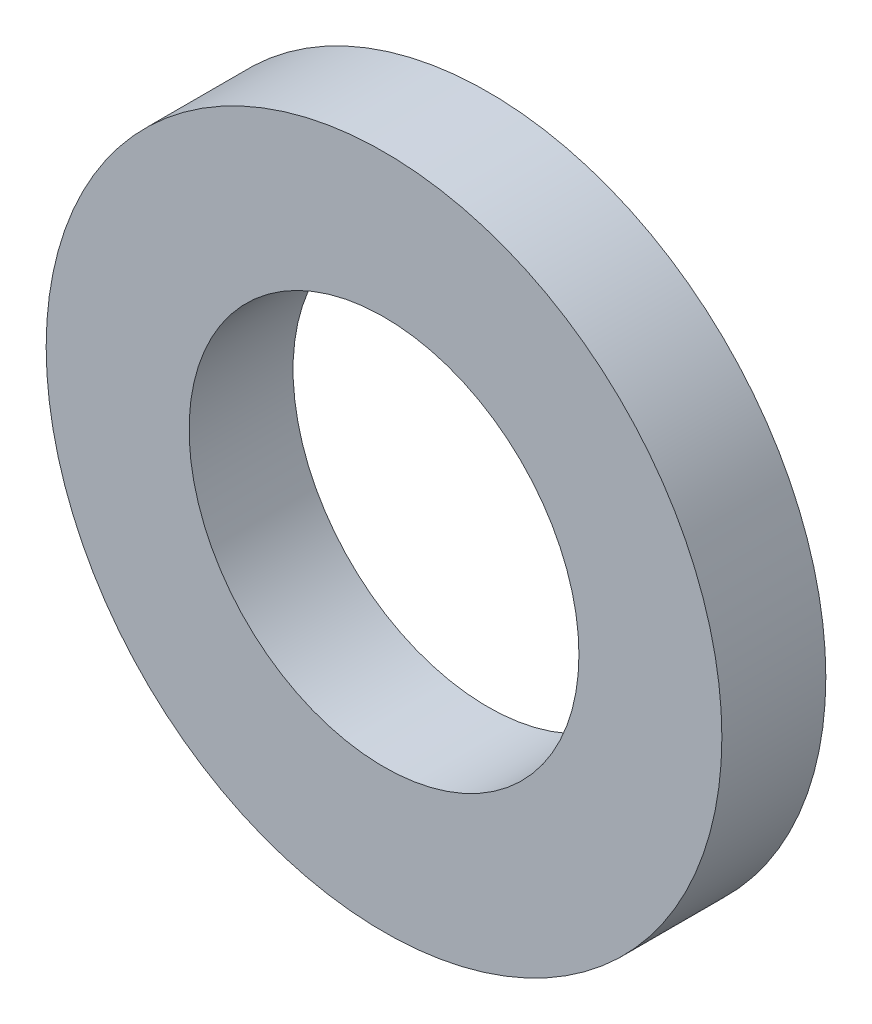
ISO-10303-21;
HEADER;
FILE_DESCRIPTION(('STEP AP214'),'2;1');
FILE_NAME('part.step','',(''),(''),'','','');
FILE_SCHEMA(('AUTOMOTIVE_DESIGN { 1 0 10303 214 1 1 1 1 }'));
ENDSEC;
DATA;
#1=APPLICATION_CONTEXT('core data for automotive mechanical design processes');
#2=APPLICATION_PROTOCOL_DEFINITION('international standard','automotive_design',2000,#1);
#3=PRODUCT_CONTEXT('',#1,'mechanical');
#4=PRODUCT('Part','Part','',(#3));
#5=PRODUCT_RELATED_PRODUCT_CATEGORY('part','',(#4));
#6=PRODUCT_DEFINITION_FORMATION('','',#4);
#7=PRODUCT_DEFINITION_CONTEXT('part definition',#1,'design');
#8=PRODUCT_DEFINITION('design','',#6,#7);
#9=PRODUCT_DEFINITION_SHAPE('','',#8);
#10=(LENGTH_UNIT() NAMED_UNIT(*) SI_UNIT(.MILLI.,.METRE.));
#11=(NAMED_UNIT(*) PLANE_ANGLE_UNIT() SI_UNIT($,.RADIAN.));
#12=(NAMED_UNIT(*) SI_UNIT($,.STERADIAN.) SOLID_ANGLE_UNIT());
#13=UNCERTAINTY_MEASURE_WITH_UNIT(LENGTH_MEASURE(1.E-05),#10,'distance_accuracy_value','');
#14=(GEOMETRIC_REPRESENTATION_CONTEXT(3) GLOBAL_UNCERTAINTY_ASSIGNED_CONTEXT((#13)) GLOBAL_UNIT_ASSIGNED_CONTEXT((#10,
#11,#12)) REPRESENTATION_CONTEXT('',''));
#15=CARTESIAN_POINT('',(0.,0.,0.));
#16=DIRECTION('',(0.,0.,1.));
#17=DIRECTION('',(1.,0.,0.));
#18=AXIS2_PLACEMENT_3D('',#15,#16,#17);
#19=CARTESIAN_POINT('',(0.,0.,4.));
#20=DIRECTION('',(0.,0.,1.));
#21=DIRECTION('',(1.,0.,0.));
#22=AXIS2_PLACEMENT_3D('',#19,#20,#21);
#23=PLANE('',#22);
#24=CARTESIAN_POINT('',(0.,0.,4.));
#25=DIRECTION('',(0.,0.,1.));
#26=DIRECTION('',(1.,0.,0.));
#27=AXIS2_PLACEMENT_3D('',#24,#25,#26);
#28=CIRCLE('',#27,13.);
#29=CARTESIAN_POINT('',(13.,0.,4.));
#30=VERTEX_POINT('',#29);
#31=EDGE_CURVE('E10',#30,#30,#28,.T.);
#32=ORIENTED_EDGE('',*,*,#31,.T.);
#33=EDGE_LOOP('',(#32));
#34=FACE_BOUND('',#33,.T.);
#35=CARTESIAN_POINT('',(0.,0.,4.));
#36=DIRECTION('',(0.,0.,1.));
#37=DIRECTION('',(1.,0.,0.));
#38=AXIS2_PLACEMENT_3D('',#35,#36,#37);
#39=CIRCLE('',#38,7.5);
#40=CARTESIAN_POINT('',(7.5,0.,4.));
#41=VERTEX_POINT('',#40);
#42=EDGE_CURVE('E50',#41,#41,#39,.T.);
#43=ORIENTED_EDGE('',*,*,#42,.F.);
#44=EDGE_LOOP('',(#43));
#45=FACE_BOUND('',#44,.T.);
#46=ADVANCED_FACE('F37',(#34,#45),#23,.T.);
#47=CARTESIAN_POINT('',(0.,0.,0.));
#48=DIRECTION('',(0.,0.,1.));
#49=DIRECTION('',(1.,0.,0.));
#50=AXIS2_PLACEMENT_3D('',#47,#48,#49);
#51=PLANE('',#50);
#52=CARTESIAN_POINT('',(0.,0.,0.));
#53=DIRECTION('',(0.,0.,1.));
#54=DIRECTION('',(1.,0.,0.));
#55=AXIS2_PLACEMENT_3D('',#52,#53,#54);
#56=CIRCLE('',#55,13.);
#57=CARTESIAN_POINT('',(13.,0.,0.));
#58=VERTEX_POINT('',#57);
#59=EDGE_CURVE('E41',#58,#58,#56,.T.);
#60=ORIENTED_EDGE('',*,*,#59,.F.);
#61=EDGE_LOOP('',(#60));
#62=FACE_BOUND('',#61,.T.);
#63=CARTESIAN_POINT('',(0.,0.,0.));
#64=DIRECTION('',(0.,0.,1.));
#65=DIRECTION('',(1.,0.,0.));
#66=AXIS2_PLACEMENT_3D('',#63,#64,#65);
#67=CIRCLE('',#66,7.5);
#68=CARTESIAN_POINT('',(7.5,0.,0.));
#69=VERTEX_POINT('',#68);
#70=EDGE_CURVE('E52',#69,#69,#67,.T.);
#71=ORIENTED_EDGE('',*,*,#70,.T.);
#72=EDGE_LOOP('',(#71));
#73=FACE_BOUND('',#72,.T.);
#74=ADVANCED_FACE('F64',(#62,#73),#51,.F.);
#75=CARTESIAN_POINT('',(0.,0.,4.));
#76=DIRECTION('',(0.,0.,-1.));
#77=DIRECTION('',(-1.,0.,0.));
#78=AXIS2_PLACEMENT_3D('',#75,#76,#77);
#79=CYLINDRICAL_SURFACE('',#78,13.);
#80=ORIENTED_EDGE('',*,*,#31,.F.);
#81=EDGE_LOOP('',(#80));
#82=FACE_BOUND('',#81,.T.);
#83=ORIENTED_EDGE('',*,*,#59,.T.);
#84=EDGE_LOOP('',(#83));
#85=FACE_BOUND('',#84,.T.);
#86=ADVANCED_FACE('F39',(#82,#85),#79,.T.);
#87=CARTESIAN_POINT('',(0.,0.,4.));
#88=DIRECTION('',(0.,0.,-1.));
#89=DIRECTION('',(-1.,0.,0.));
#90=AXIS2_PLACEMENT_3D('',#87,#88,#89);
#91=CYLINDRICAL_SURFACE('',#90,7.5);
#92=ORIENTED_EDGE('',*,*,#42,.T.);
#93=EDGE_LOOP('',(#92));
#94=FACE_BOUND('',#93,.T.);
#95=ORIENTED_EDGE('',*,*,#70,.F.);
#96=EDGE_LOOP('',(#95));
#97=FACE_BOUND('',#96,.T.);
#98=ADVANCED_FACE('F60',(#94,#97),#91,.F.);
#99=CLOSED_SHELL('',(#46,#74,#86,#98));
#100=MANIFOLD_SOLID_BREP('B2',#99);
#101=ADVANCED_BREP_SHAPE_REPRESENTATION('',(#18,#100),#14);
#102=SHAPE_DEFINITION_REPRESENTATION(#9,#101);
ENDSEC;
END-ISO-10303-21;
